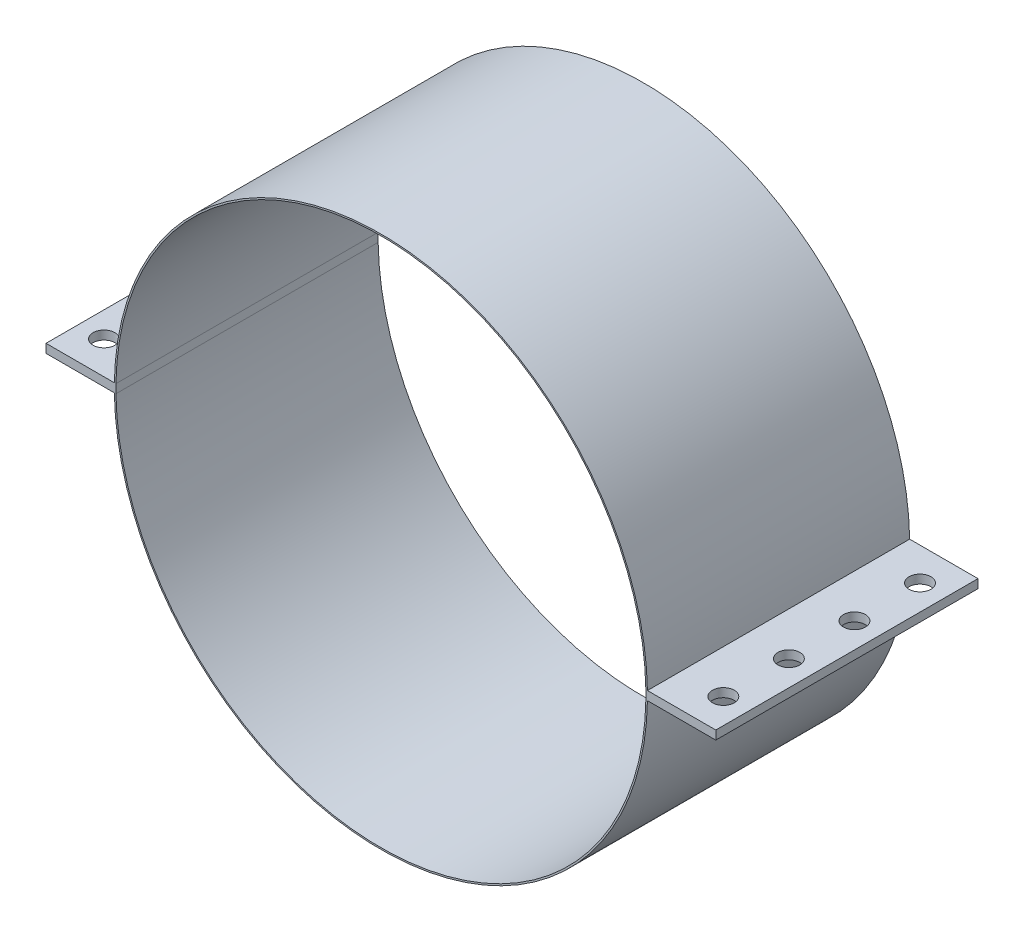
ISO-10303-21;
HEADER;
FILE_DESCRIPTION(('STEP AP214'),'2;1');
FILE_NAME('part.step','',(''),(''),'','','');
FILE_SCHEMA(('AUTOMOTIVE_DESIGN { 1 0 10303 214 1 1 1 1 }'));
ENDSEC;
DATA;
#1=APPLICATION_CONTEXT('core data for automotive mechanical design processes');
#2=APPLICATION_PROTOCOL_DEFINITION('international standard','automotive_design',2000,#1);
#3=PRODUCT_CONTEXT('',#1,'mechanical');
#4=PRODUCT('Part','Part','',(#3));
#5=PRODUCT_RELATED_PRODUCT_CATEGORY('part','',(#4));
#6=PRODUCT_DEFINITION_FORMATION('','',#4);
#7=PRODUCT_DEFINITION_CONTEXT('part definition',#1,'design');
#8=PRODUCT_DEFINITION('design','',#6,#7);
#9=PRODUCT_DEFINITION_SHAPE('','',#8);
#10=(LENGTH_UNIT() NAMED_UNIT(*) SI_UNIT(.MILLI.,.METRE.));
#11=(NAMED_UNIT(*) PLANE_ANGLE_UNIT() SI_UNIT($,.RADIAN.));
#12=(NAMED_UNIT(*) SI_UNIT($,.STERADIAN.) SOLID_ANGLE_UNIT());
#13=UNCERTAINTY_MEASURE_WITH_UNIT(LENGTH_MEASURE(1.E-05),#10,'distance_accuracy_value','');
#14=(GEOMETRIC_REPRESENTATION_CONTEXT(3) GLOBAL_UNCERTAINTY_ASSIGNED_CONTEXT((#13)) GLOBAL_UNIT_ASSIGNED_CONTEXT((#10,
#11,#12)) REPRESENTATION_CONTEXT('',''));
#15=CARTESIAN_POINT('',(0.,0.,0.));
#16=DIRECTION('',(0.,0.,1.));
#17=DIRECTION('',(1.,0.,0.));
#18=AXIS2_PLACEMENT_3D('',#15,#16,#17);
#19=CARTESIAN_POINT('',(0.,0.,76.2));
#20=DIRECTION('',(0.,0.,-1.));
#21=DIRECTION('',(-1.,0.,0.));
#22=AXIS2_PLACEMENT_3D('',#19,#20,#21);
#23=CYLINDRICAL_SURFACE('',#22,77.47);
#24=CARTESIAN_POINT('',(0.,0.,76.2));
#25=DIRECTION('',(0.,0.,1.));
#26=DIRECTION('',(1.,0.,0.));
#27=AXIS2_PLACEMENT_3D('',#24,#25,#26);
#28=CIRCLE('',#27,77.47);
#29=CARTESIAN_POINT('',(-77.4595894644427,-1.26999999999998,76.2));
#30=VERTEX_POINT('',#29);
#31=CARTESIAN_POINT('',(77.4595894644427,-1.27,76.2));
#32=VERTEX_POINT('',#31);
#33=EDGE_CURVE('E46',#30,#32,#28,.T.);
#34=ORIENTED_EDGE('',*,*,#33,.F.);
#35=DIRECTION('',(0.,0.,-1.));
#36=VECTOR('',#35,1.);
#37=CARTESIAN_POINT('',(-77.4595894644427,-1.26999999999998,76.2));
#38=LINE('',#37,#36);
#39=CARTESIAN_POINT('',(-77.4595894644427,-1.26999999999998,0.));
#40=VERTEX_POINT('',#39);
#41=EDGE_CURVE('E154',#30,#40,#38,.T.);
#42=ORIENTED_EDGE('',*,*,#41,.T.);
#43=CARTESIAN_POINT('',(0.,0.,0.));
#44=DIRECTION('',(0.,0.,1.));
#45=DIRECTION('',(1.,0.,0.));
#46=AXIS2_PLACEMENT_3D('',#43,#44,#45);
#47=CIRCLE('',#46,77.47);
#48=CARTESIAN_POINT('',(77.4595894644427,-1.27,0.));
#49=VERTEX_POINT('',#48);
#50=EDGE_CURVE('E205',#40,#49,#47,.T.);
#51=ORIENTED_EDGE('',*,*,#50,.T.);
#52=DIRECTION('',(0.,0.,-1.));
#53=VECTOR('',#52,1.);
#54=CARTESIAN_POINT('',(77.4595894644427,-1.27,76.2));
#55=LINE('',#54,#53);
#56=EDGE_CURVE('E193',#49,#32,#55,.F.);
#57=ORIENTED_EDGE('',*,*,#56,.T.);
#58=EDGE_LOOP('',(#34,#42,#51,#57));
#59=FACE_BOUND('',#58,.T.);
#60=ADVANCED_FACE('F37',(#59),#23,.T.);
#61=CARTESIAN_POINT('',(0.,0.,76.2));
#62=DIRECTION('',(0.,0.,-1.));
#63=DIRECTION('',(-1.,0.,0.));
#64=AXIS2_PLACEMENT_3D('',#61,#62,#63);
#65=CYLINDRICAL_SURFACE('',#64,77.0128);
#66=DIRECTION('',(0.,0.,1.));
#67=VECTOR('',#66,1.);
#68=CARTESIAN_POINT('',(-77.0023276520911,-1.26999999999998,0.));
#69=LINE('',#68,#67);
#70=CARTESIAN_POINT('',(-77.0023276520912,-1.26999999999998,0.));
#71=VERTEX_POINT('',#70);
#72=CARTESIAN_POINT('',(-77.0023276520911,-1.26999999999998,76.2));
#73=VERTEX_POINT('',#72);
#74=EDGE_CURVE('E139',#71,#73,#69,.T.);
#75=ORIENTED_EDGE('',*,*,#74,.T.);
#76=CARTESIAN_POINT('',(0.,0.,76.2));
#77=DIRECTION('',(0.,0.,1.));
#78=DIRECTION('',(1.,0.,0.));
#79=AXIS2_PLACEMENT_3D('',#76,#77,#78);
#80=CIRCLE('',#79,77.0128);
#81=CARTESIAN_POINT('',(77.0023276520912,-1.27,76.2));
#82=VERTEX_POINT('',#81);
#83=EDGE_CURVE('E129',#73,#82,#80,.T.);
#84=ORIENTED_EDGE('',*,*,#83,.T.);
#85=DIRECTION('',(0.,0.,1.));
#86=VECTOR('',#85,1.);
#87=CARTESIAN_POINT('',(77.0023276520912,-1.27,0.));
#88=LINE('',#87,#86);
#89=CARTESIAN_POINT('',(77.0023276520912,-1.27,0.));
#90=VERTEX_POINT('',#89);
#91=EDGE_CURVE('E182',#90,#82,#88,.T.);
#92=ORIENTED_EDGE('',*,*,#91,.F.);
#93=CARTESIAN_POINT('',(0.,0.,0.));
#94=DIRECTION('',(0.,0.,1.));
#95=DIRECTION('',(1.,0.,0.));
#96=AXIS2_PLACEMENT_3D('',#93,#94,#95);
#97=CIRCLE('',#96,77.0128);
#98=EDGE_CURVE('E61',#71,#90,#97,.T.);
#99=ORIENTED_EDGE('',*,*,#98,.F.);
#100=EDGE_LOOP('',(#75,#84,#92,#99));
#101=FACE_BOUND('',#100,.T.);
#102=ADVANCED_FACE('F140',(#101),#65,.F.);
#103=CARTESIAN_POINT('',(0.,0.,76.2));
#104=DIRECTION('',(0.,0.,1.));
#105=DIRECTION('',(1.,0.,0.));
#106=AXIS2_PLACEMENT_3D('',#103,#104,#105);
#107=PLANE('',#106);
#108=ORIENTED_EDGE('',*,*,#83,.F.);
#109=DIRECTION('',(0.,1.,0.));
#110=VECTOR('',#109,1.);
#111=CARTESIAN_POINT('',(-77.0023276520911,-1.26999999999998,76.2));
#112=LINE('',#111,#110);
#113=CARTESIAN_POINT('',(-77.0023276520911,1.27000000000192,76.2));
#114=VERTEX_POINT('',#113);
#115=EDGE_CURVE('E132',#73,#114,#112,.T.);
#116=ORIENTED_EDGE('',*,*,#115,.T.);
#117=CARTESIAN_POINT('',(77.0023276520912,1.27,76.2));
#118=VERTEX_POINT('',#117);
#119=EDGE_CURVE('E136',#118,#114,#80,.T.);
#120=ORIENTED_EDGE('',*,*,#119,.F.);
#121=DIRECTION('',(0.,-1.,0.));
#122=VECTOR('',#121,1.);
#123=CARTESIAN_POINT('',(77.0023276520912,-1.27,76.2));
#124=LINE('',#123,#122);
#125=EDGE_CURVE('E134',#118,#82,#124,.T.);
#126=ORIENTED_EDGE('',*,*,#125,.T.);
#127=EDGE_LOOP('',(#108,#116,#120,#126));
#128=FACE_BOUND('',#127,.T.);
#129=DIRECTION('',(1.,0.,0.));
#130=VECTOR('',#129,1.);
#131=CARTESIAN_POINT('',(-77.0023276520911,-1.26999999999998,76.2));
#132=LINE('',#131,#130);
#133=CARTESIAN_POINT('',(-97.3223276520911,-1.26999999999998,76.2));
#134=VERTEX_POINT('',#133);
#135=EDGE_CURVE('E53',#134,#30,#132,.T.);
#136=ORIENTED_EDGE('',*,*,#135,.T.);
#137=ORIENTED_EDGE('',*,*,#33,.T.);
#138=DIRECTION('',(1.,0.,0.));
#139=VECTOR('',#138,1.);
#140=CARTESIAN_POINT('',(77.0023276520912,-1.27,76.2));
#141=LINE('',#140,#139);
#142=CARTESIAN_POINT('',(97.3223276520912,-1.27,76.2));
#143=VERTEX_POINT('',#142);
#144=EDGE_CURVE('E184',#32,#143,#141,.T.);
#145=ORIENTED_EDGE('',*,*,#144,.T.);
#146=DIRECTION('',(0.,1.,0.));
#147=VECTOR('',#146,1.);
#148=CARTESIAN_POINT('',(97.3223276520912,-1.27,76.2));
#149=LINE('',#148,#147);
#150=CARTESIAN_POINT('',(97.3223276520912,1.27,76.2));
#151=VERTEX_POINT('',#150);
#152=EDGE_CURVE('E186',#143,#151,#149,.T.);
#153=ORIENTED_EDGE('',*,*,#152,.T.);
#154=DIRECTION('',(-1.,0.,0.));
#155=VECTOR('',#154,1.);
#156=CARTESIAN_POINT('',(77.0023276520912,1.27,76.2));
#157=LINE('',#156,#155);
#158=CARTESIAN_POINT('',(77.4595894644427,1.27,76.2));
#159=VERTEX_POINT('',#158);
#160=EDGE_CURVE('E175',#151,#159,#157,.T.);
#161=ORIENTED_EDGE('',*,*,#160,.T.);
#162=CARTESIAN_POINT('',(-77.4595894644427,1.26999999999998,76.2));
#163=VERTEX_POINT('',#162);
#164=EDGE_CURVE('E11',#159,#163,#28,.T.);
#165=ORIENTED_EDGE('',*,*,#164,.T.);
#166=DIRECTION('',(-1.,0.,0.));
#167=VECTOR('',#166,1.);
#168=CARTESIAN_POINT('',(-77.0023276520911,1.26999999999998,76.2));
#169=LINE('',#168,#167);
#170=CARTESIAN_POINT('',(-97.3223276520911,1.26999999999998,76.2));
#171=VERTEX_POINT('',#170);
#172=EDGE_CURVE('E151',#163,#171,#169,.T.);
#173=ORIENTED_EDGE('',*,*,#172,.T.);
#174=DIRECTION('',(0.,-1.,0.));
#175=VECTOR('',#174,1.);
#176=CARTESIAN_POINT('',(-97.3223276520911,-1.26999999999998,76.2));
#177=LINE('',#176,#175);
#178=EDGE_CURVE('E156',#171,#134,#177,.T.);
#179=ORIENTED_EDGE('',*,*,#178,.T.);
#180=EDGE_LOOP('',(#136,#137,#145,#153,#161,#165,#173,#179));
#181=FACE_BOUND('',#180,.T.);
#182=ADVANCED_FACE('F130',(#128,#181),#107,.T.);
#183=CARTESIAN_POINT('',(0.,0.,0.));
#184=DIRECTION('',(0.,0.,1.));
#185=DIRECTION('',(1.,0.,0.));
#186=AXIS2_PLACEMENT_3D('',#183,#184,#185);
#187=PLANE('',#186);
#188=DIRECTION('',(0.,1.,0.));
#189=VECTOR('',#188,1.);
#190=CARTESIAN_POINT('',(-77.0023276520911,-1.26999999999998,0.));
#191=LINE('',#190,#189);
#192=CARTESIAN_POINT('',(-77.0023276520911,1.27000000000192,0.));
#193=VERTEX_POINT('',#192);
#194=EDGE_CURVE('E167',#71,#193,#191,.T.);
#195=ORIENTED_EDGE('',*,*,#194,.F.);
#196=ORIENTED_EDGE('',*,*,#98,.T.);
#197=DIRECTION('',(0.,-1.,0.));
#198=VECTOR('',#197,1.);
#199=CARTESIAN_POINT('',(77.0023276520912,-1.27,0.));
#200=LINE('',#199,#198);
#201=CARTESIAN_POINT('',(77.0023276520912,1.27,0.));
#202=VERTEX_POINT('',#201);
#203=EDGE_CURVE('E171',#202,#90,#200,.T.);
#204=ORIENTED_EDGE('',*,*,#203,.F.);
#205=EDGE_CURVE('E137',#202,#193,#97,.T.);
#206=ORIENTED_EDGE('',*,*,#205,.T.);
#207=EDGE_LOOP('',(#195,#196,#204,#206));
#208=FACE_BOUND('',#207,.T.);
#209=ORIENTED_EDGE('',*,*,#50,.F.);
#210=DIRECTION('',(1.,0.,0.));
#211=VECTOR('',#210,1.);
#212=CARTESIAN_POINT('',(-77.0023276520911,-1.26999999999998,0.));
#213=LINE('',#212,#211);
#214=CARTESIAN_POINT('',(-97.3223276520911,-1.26999999999998,0.));
#215=VERTEX_POINT('',#214);
#216=EDGE_CURVE('E160',#215,#40,#213,.T.);
#217=ORIENTED_EDGE('',*,*,#216,.F.);
#218=DIRECTION('',(0.,-1.,0.));
#219=VECTOR('',#218,1.);
#220=CARTESIAN_POINT('',(-97.3223276520911,-1.26999999999998,0.));
#221=LINE('',#220,#219);
#222=CARTESIAN_POINT('',(-97.3223276520911,1.26999999999998,0.));
#223=VERTEX_POINT('',#222);
#224=EDGE_CURVE('E162',#223,#215,#221,.T.);
#225=ORIENTED_EDGE('',*,*,#224,.F.);
#226=DIRECTION('',(-1.,0.,0.));
#227=VECTOR('',#226,1.);
#228=CARTESIAN_POINT('',(-77.0023276520911,1.26999999999998,0.));
#229=LINE('',#228,#227);
#230=CARTESIAN_POINT('',(-77.4595894644427,1.26999999999998,0.));
#231=VERTEX_POINT('',#230);
#232=EDGE_CURVE('E165',#231,#223,#229,.T.);
#233=ORIENTED_EDGE('',*,*,#232,.F.);
#234=CARTESIAN_POINT('',(77.4595894644427,1.27,0.));
#235=VERTEX_POINT('',#234);
#236=EDGE_CURVE('E41',#235,#231,#47,.T.);
#237=ORIENTED_EDGE('',*,*,#236,.F.);
#238=DIRECTION('',(-1.,0.,0.));
#239=VECTOR('',#238,1.);
#240=CARTESIAN_POINT('',(77.0023276520912,1.27,0.));
#241=LINE('',#240,#239);
#242=CARTESIAN_POINT('',(97.3223276520912,1.27,0.));
#243=VERTEX_POINT('',#242);
#244=EDGE_CURVE('E180',#243,#235,#241,.T.);
#245=ORIENTED_EDGE('',*,*,#244,.F.);
#246=DIRECTION('',(0.,1.,0.));
#247=VECTOR('',#246,1.);
#248=CARTESIAN_POINT('',(97.3223276520912,-1.27,0.));
#249=LINE('',#248,#247);
#250=CARTESIAN_POINT('',(97.3223276520912,-1.27,0.));
#251=VERTEX_POINT('',#250);
#252=EDGE_CURVE('E177',#251,#243,#249,.T.);
#253=ORIENTED_EDGE('',*,*,#252,.F.);
#254=DIRECTION('',(1.,0.,0.));
#255=VECTOR('',#254,1.);
#256=CARTESIAN_POINT('',(77.0023276520912,-1.27,0.));
#257=LINE('',#256,#255);
#258=EDGE_CURVE('E174',#49,#251,#257,.T.);
#259=ORIENTED_EDGE('',*,*,#258,.F.);
#260=EDGE_LOOP('',(#209,#217,#225,#233,#237,#245,#253,#259));
#261=FACE_BOUND('',#260,.T.);
#262=ADVANCED_FACE('F209',(#208,#261),#187,.F.);
#263=ORIENTED_EDGE('',*,*,#236,.T.);
#264=DIRECTION('',(0.,0.,-1.));
#265=VECTOR('',#264,1.);
#266=CARTESIAN_POINT('',(-77.4595894644427,1.26999999999998,76.2));
#267=LINE('',#266,#265);
#268=EDGE_CURVE('E150',#231,#163,#267,.F.);
#269=ORIENTED_EDGE('',*,*,#268,.T.);
#270=ORIENTED_EDGE('',*,*,#164,.F.);
#271=DIRECTION('',(0.,0.,-1.));
#272=VECTOR('',#271,1.);
#273=CARTESIAN_POINT('',(77.4595894644427,1.27,76.2));
#274=LINE('',#273,#272);
#275=EDGE_CURVE('E202',#159,#235,#274,.T.);
#276=ORIENTED_EDGE('',*,*,#275,.T.);
#277=EDGE_LOOP('',(#263,#269,#270,#276));
#278=FACE_BOUND('',#277,.T.);
#279=ADVANCED_FACE('F39',(#278),#23,.T.);
#280=DIRECTION('',(0.,0.,1.));
#281=VECTOR('',#280,1.);
#282=CARTESIAN_POINT('',(-77.0023276520911,1.26999999999998,0.));
#283=LINE('',#282,#281);
#284=EDGE_CURVE('E149',#193,#114,#283,.T.);
#285=ORIENTED_EDGE('',*,*,#284,.F.);
#286=ORIENTED_EDGE('',*,*,#205,.F.);
#287=DIRECTION('',(0.,0.,1.));
#288=VECTOR('',#287,1.);
#289=CARTESIAN_POINT('',(77.0023276520912,1.27,0.));
#290=LINE('',#289,#288);
#291=EDGE_CURVE('E190',#202,#118,#290,.T.);
#292=ORIENTED_EDGE('',*,*,#291,.T.);
#293=ORIENTED_EDGE('',*,*,#119,.T.);
#294=EDGE_LOOP('',(#285,#286,#292,#293));
#295=FACE_BOUND('',#294,.T.);
#296=ADVANCED_FACE('F215',(#295),#65,.F.);
#297=CARTESIAN_POINT('',(77.0023276520912,-1.27,0.));
#298=DIRECTION('',(-1.,0.,0.));
#299=DIRECTION('',(0.,0.,1.));
#300=AXIS2_PLACEMENT_3D('',#297,#298,#299);
#301=PLANE('',#300);
#302=ORIENTED_EDGE('',*,*,#125,.F.);
#303=ORIENTED_EDGE('',*,*,#291,.F.);
#304=ORIENTED_EDGE('',*,*,#203,.T.);
#305=ORIENTED_EDGE('',*,*,#91,.T.);
#306=EDGE_LOOP('',(#302,#303,#304,#305));
#307=FACE_BOUND('',#306,.T.);
#308=ADVANCED_FACE('F213',(#307),#301,.T.);
#309=CARTESIAN_POINT('',(77.0023276520912,1.27,0.));
#310=DIRECTION('',(0.,1.,0.));
#311=DIRECTION('',(-1.,0.,0.));
#312=AXIS2_PLACEMENT_3D('',#309,#310,#311);
#313=PLANE('',#312);
#314=CARTESIAN_POINT('',(89.9952514644427,1.27,9.52500000000001));
#315=DIRECTION('',(0.,1.,0.));
#316=DIRECTION('',(-1.,0.,0.));
#317=AXIS2_PLACEMENT_3D('',#314,#315,#316);
#318=CIRCLE('',#317,3.175);
#319=CARTESIAN_POINT('',(86.8202514644427,1.27,9.52500000000001));
#320=VERTEX_POINT('',#319);
#321=EDGE_CURVE('E321',#320,#320,#318,.T.);
#322=ORIENTED_EDGE('',*,*,#321,.F.);
#323=EDGE_LOOP('',(#322));
#324=FACE_BOUND('',#323,.T.);
#325=CARTESIAN_POINT('',(89.9952514644427,1.27,28.575));
#326=DIRECTION('',(0.,1.,0.));
#327=DIRECTION('',(-1.,0.,0.));
#328=AXIS2_PLACEMENT_3D('',#325,#326,#327);
#329=CIRCLE('',#328,3.175);
#330=CARTESIAN_POINT('',(86.8202514644427,1.27,28.575));
#331=VERTEX_POINT('',#330);
#332=EDGE_CURVE('E322',#331,#331,#329,.T.);
#333=ORIENTED_EDGE('',*,*,#332,.F.);
#334=EDGE_LOOP('',(#333));
#335=FACE_BOUND('',#334,.T.);
#336=CARTESIAN_POINT('',(89.9952514644427,1.27,47.625));
#337=DIRECTION('',(0.,1.,0.));
#338=DIRECTION('',(-1.,0.,0.));
#339=AXIS2_PLACEMENT_3D('',#336,#337,#338);
#340=CIRCLE('',#339,3.175);
#341=CARTESIAN_POINT('',(86.8202514644427,1.27,47.625));
#342=VERTEX_POINT('',#341);
#343=EDGE_CURVE('E345',#342,#342,#340,.T.);
#344=ORIENTED_EDGE('',*,*,#343,.F.);
#345=EDGE_LOOP('',(#344));
#346=FACE_BOUND('',#345,.T.);
#347=CARTESIAN_POINT('',(89.9952514644427,1.27,66.675));
#348=DIRECTION('',(0.,1.,0.));
#349=DIRECTION('',(-1.,0.,0.));
#350=AXIS2_PLACEMENT_3D('',#347,#348,#349);
#351=CIRCLE('',#350,3.175);
#352=CARTESIAN_POINT('',(86.8202514644427,1.27,66.675));
#353=VERTEX_POINT('',#352);
#354=EDGE_CURVE('E339',#353,#353,#351,.T.);
#355=ORIENTED_EDGE('',*,*,#354,.F.);
#356=EDGE_LOOP('',(#355));
#357=FACE_BOUND('',#356,.T.);
#358=ORIENTED_EDGE('',*,*,#275,.F.);
#359=ORIENTED_EDGE('',*,*,#160,.F.);
#360=DIRECTION('',(0.,0.,1.));
#361=VECTOR('',#360,1.);
#362=CARTESIAN_POINT('',(97.3223276520912,1.27,0.));
#363=LINE('',#362,#361);
#364=EDGE_CURVE('E194',#243,#151,#363,.T.);
#365=ORIENTED_EDGE('',*,*,#364,.F.);
#366=ORIENTED_EDGE('',*,*,#244,.T.);
#367=EDGE_LOOP('',(#358,#359,#365,#366));
#368=FACE_BOUND('',#367,.T.);
#369=ADVANCED_FACE('F251',(#324,#335,#346,#357,#368),#313,.T.);
#370=CARTESIAN_POINT('',(77.0023276520912,-1.27,0.));
#371=DIRECTION('',(0.,-1.,0.));
#372=DIRECTION('',(1.,0.,0.));
#373=AXIS2_PLACEMENT_3D('',#370,#371,#372);
#374=PLANE('',#373);
#375=CARTESIAN_POINT('',(89.9952514644427,-1.27,9.52500000000001));
#376=DIRECTION('',(0.,1.,0.));
#377=DIRECTION('',(-1.,0.,0.));
#378=AXIS2_PLACEMENT_3D('',#375,#376,#377);
#379=CIRCLE('',#378,3.175);
#380=CARTESIAN_POINT('',(86.8202514644427,-1.27,9.52500000000001));
#381=VERTEX_POINT('',#380);
#382=EDGE_CURVE('E318',#381,#381,#379,.T.);
#383=ORIENTED_EDGE('',*,*,#382,.T.);
#384=EDGE_LOOP('',(#383));
#385=FACE_BOUND('',#384,.T.);
#386=CARTESIAN_POINT('',(89.9952514644427,-1.27,28.575));
#387=DIRECTION('',(0.,1.,0.));
#388=DIRECTION('',(-1.,0.,0.));
#389=AXIS2_PLACEMENT_3D('',#386,#387,#388);
#390=CIRCLE('',#389,3.175);
#391=CARTESIAN_POINT('',(86.8202514644427,-1.27,28.575));
#392=VERTEX_POINT('',#391);
#393=EDGE_CURVE('E348',#392,#392,#390,.T.);
#394=ORIENTED_EDGE('',*,*,#393,.T.);
#395=EDGE_LOOP('',(#394));
#396=FACE_BOUND('',#395,.T.);
#397=CARTESIAN_POINT('',(89.9952514644427,-1.27,47.625));
#398=DIRECTION('',(0.,1.,0.));
#399=DIRECTION('',(-1.,0.,0.));
#400=AXIS2_PLACEMENT_3D('',#397,#398,#399);
#401=CIRCLE('',#400,3.175);
#402=CARTESIAN_POINT('',(86.8202514644427,-1.27,47.625));
#403=VERTEX_POINT('',#402);
#404=EDGE_CURVE('E342',#403,#403,#401,.T.);
#405=ORIENTED_EDGE('',*,*,#404,.T.);
#406=EDGE_LOOP('',(#405));
#407=FACE_BOUND('',#406,.T.);
#408=CARTESIAN_POINT('',(89.9952514644427,-1.27,66.675));
#409=DIRECTION('',(0.,1.,0.));
#410=DIRECTION('',(-1.,0.,0.));
#411=AXIS2_PLACEMENT_3D('',#408,#409,#410);
#412=CIRCLE('',#411,3.175);
#413=CARTESIAN_POINT('',(86.8202514644427,-1.27,66.675));
#414=VERTEX_POINT('',#413);
#415=EDGE_CURVE('E336',#414,#414,#412,.T.);
#416=ORIENTED_EDGE('',*,*,#415,.T.);
#417=EDGE_LOOP('',(#416));
#418=FACE_BOUND('',#417,.T.);
#419=ORIENTED_EDGE('',*,*,#56,.F.);
#420=ORIENTED_EDGE('',*,*,#258,.T.);
#421=DIRECTION('',(0.,0.,1.));
#422=VECTOR('',#421,1.);
#423=CARTESIAN_POINT('',(97.3223276520912,-1.27,0.));
#424=LINE('',#423,#422);
#425=EDGE_CURVE('E196',#251,#143,#424,.T.);
#426=ORIENTED_EDGE('',*,*,#425,.T.);
#427=ORIENTED_EDGE('',*,*,#144,.F.);
#428=EDGE_LOOP('',(#419,#420,#426,#427));
#429=FACE_BOUND('',#428,.T.);
#430=ADVANCED_FACE('F241',(#385,#396,#407,#418,#429),#374,.T.);
#431=CARTESIAN_POINT('',(97.3223276520912,-1.27,0.));
#432=DIRECTION('',(1.,0.,0.));
#433=DIRECTION('',(0.,0.,-1.));
#434=AXIS2_PLACEMENT_3D('',#431,#432,#433);
#435=PLANE('',#434);
#436=ORIENTED_EDGE('',*,*,#152,.F.);
#437=ORIENTED_EDGE('',*,*,#425,.F.);
#438=ORIENTED_EDGE('',*,*,#252,.T.);
#439=ORIENTED_EDGE('',*,*,#364,.T.);
#440=EDGE_LOOP('',(#436,#437,#438,#439));
#441=FACE_BOUND('',#440,.T.);
#442=ADVANCED_FACE('F247',(#441),#435,.T.);
#443=CARTESIAN_POINT('',(-77.0023276520911,-1.26999999999998,0.));
#444=DIRECTION('',(1.,0.,0.));
#445=DIRECTION('',(0.,0.,-1.));
#446=AXIS2_PLACEMENT_3D('',#443,#444,#445);
#447=PLANE('',#446);
#448=ORIENTED_EDGE('',*,*,#115,.F.);
#449=ORIENTED_EDGE('',*,*,#74,.F.);
#450=ORIENTED_EDGE('',*,*,#194,.T.);
#451=ORIENTED_EDGE('',*,*,#284,.T.);
#452=EDGE_LOOP('',(#448,#449,#450,#451));
#453=FACE_BOUND('',#452,.T.);
#454=ADVANCED_FACE('F148',(#453),#447,.T.);
#455=CARTESIAN_POINT('',(-77.0023276520911,-1.26999999999998,0.));
#456=DIRECTION('',(0.,-1.,0.));
#457=DIRECTION('',(1.,0.,0.));
#458=AXIS2_PLACEMENT_3D('',#455,#456,#457);
#459=PLANE('',#458);
#460=CARTESIAN_POINT('',(-89.9952514644427,-1.27,47.625));
#461=DIRECTION('',(0.,-1.,0.));
#462=DIRECTION('',(1.,0.,0.));
#463=AXIS2_PLACEMENT_3D('',#460,#461,#462);
#464=CIRCLE('',#463,3.175);
#465=CARTESIAN_POINT('',(-86.8202514644427,-1.27,47.625));
#466=VERTEX_POINT('',#465);
#467=EDGE_CURVE('E304',#466,#466,#464,.T.);
#468=ORIENTED_EDGE('',*,*,#467,.F.);
#469=EDGE_LOOP('',(#468));
#470=FACE_BOUND('',#469,.T.);
#471=CARTESIAN_POINT('',(-89.9952514644427,-1.27,28.575));
#472=DIRECTION('',(0.,-1.,0.));
#473=DIRECTION('',(1.,0.,0.));
#474=AXIS2_PLACEMENT_3D('',#471,#472,#473);
#475=CIRCLE('',#474,3.175);
#476=CARTESIAN_POINT('',(-86.8202514644427,-1.27,28.575));
#477=VERTEX_POINT('',#476);
#478=EDGE_CURVE('E308',#477,#477,#475,.T.);
#479=ORIENTED_EDGE('',*,*,#478,.F.);
#480=EDGE_LOOP('',(#479));
#481=FACE_BOUND('',#480,.T.);
#482=CARTESIAN_POINT('',(-89.9952514644427,-1.27,9.52500000000003));
#483=DIRECTION('',(0.,-1.,0.));
#484=DIRECTION('',(1.,0.,0.));
#485=AXIS2_PLACEMENT_3D('',#482,#483,#484);
#486=CIRCLE('',#485,3.175);
#487=CARTESIAN_POINT('',(-86.8202514644427,-1.27,9.52500000000003));
#488=VERTEX_POINT('',#487);
#489=EDGE_CURVE('E312',#488,#488,#486,.T.);
#490=ORIENTED_EDGE('',*,*,#489,.F.);
#491=EDGE_LOOP('',(#490));
#492=FACE_BOUND('',#491,.T.);
#493=CARTESIAN_POINT('',(-89.9952514644427,-1.27,66.675));
#494=DIRECTION('',(0.,-1.,0.));
#495=DIRECTION('',(1.,0.,0.));
#496=AXIS2_PLACEMENT_3D('',#493,#494,#495);
#497=CIRCLE('',#496,3.175);
#498=CARTESIAN_POINT('',(-86.8202514644427,-1.27,66.675));
#499=VERTEX_POINT('',#498);
#500=EDGE_CURVE('E145',#499,#499,#497,.T.);
#501=ORIENTED_EDGE('',*,*,#500,.F.);
#502=EDGE_LOOP('',(#501));
#503=FACE_BOUND('',#502,.T.);
#504=ORIENTED_EDGE('',*,*,#41,.F.);
#505=ORIENTED_EDGE('',*,*,#135,.F.);
#506=DIRECTION('',(0.,0.,1.));
#507=VECTOR('',#506,1.);
#508=CARTESIAN_POINT('',(-97.3223276520911,-1.26999999999998,0.));
#509=LINE('',#508,#507);
#510=EDGE_CURVE('E144',#215,#134,#509,.T.);
#511=ORIENTED_EDGE('',*,*,#510,.F.);
#512=ORIENTED_EDGE('',*,*,#216,.T.);
#513=EDGE_LOOP('',(#504,#505,#511,#512));
#514=FACE_BOUND('',#513,.T.);
#515=ADVANCED_FACE('F229',(#470,#481,#492,#503,#514),#459,.T.);
#516=CARTESIAN_POINT('',(-77.0023276520911,1.26999999999998,0.));
#517=DIRECTION('',(0.,1.,0.));
#518=DIRECTION('',(-1.,0.,0.));
#519=AXIS2_PLACEMENT_3D('',#516,#517,#518);
#520=PLANE('',#519);
#521=CARTESIAN_POINT('',(-89.9952514644427,1.27,47.625));
#522=DIRECTION('',(0.,-1.,0.));
#523=DIRECTION('',(1.,0.,0.));
#524=AXIS2_PLACEMENT_3D('',#521,#522,#523);
#525=CIRCLE('',#524,3.175);
#526=CARTESIAN_POINT('',(-86.8202514644427,1.27,47.625));
#527=VERTEX_POINT('',#526);
#528=EDGE_CURVE('E316',#527,#527,#525,.T.);
#529=ORIENTED_EDGE('',*,*,#528,.T.);
#530=EDGE_LOOP('',(#529));
#531=FACE_BOUND('',#530,.T.);
#532=CARTESIAN_POINT('',(-89.9952514644427,1.27,28.575));
#533=DIRECTION('',(0.,-1.,0.));
#534=DIRECTION('',(1.,0.,0.));
#535=AXIS2_PLACEMENT_3D('',#532,#533,#534);
#536=CIRCLE('',#535,3.175);
#537=CARTESIAN_POINT('',(-86.8202514644427,1.27,28.575));
#538=VERTEX_POINT('',#537);
#539=EDGE_CURVE('E330',#538,#538,#536,.T.);
#540=ORIENTED_EDGE('',*,*,#539,.T.);
#541=EDGE_LOOP('',(#540));
#542=FACE_BOUND('',#541,.T.);
#543=CARTESIAN_POINT('',(-89.9952514644427,1.27,9.52500000000003));
#544=DIRECTION('',(0.,-1.,0.));
#545=DIRECTION('',(1.,0.,0.));
#546=AXIS2_PLACEMENT_3D('',#543,#544,#545);
#547=CIRCLE('',#546,3.175);
#548=CARTESIAN_POINT('',(-86.8202514644427,1.27,9.52500000000003));
#549=VERTEX_POINT('',#548);
#550=EDGE_CURVE('E326',#549,#549,#547,.T.);
#551=ORIENTED_EDGE('',*,*,#550,.T.);
#552=EDGE_LOOP('',(#551));
#553=FACE_BOUND('',#552,.T.);
#554=CARTESIAN_POINT('',(-89.9952514644427,1.27,66.675));
#555=DIRECTION('',(0.,-1.,0.));
#556=DIRECTION('',(1.,0.,0.));
#557=AXIS2_PLACEMENT_3D('',#554,#555,#556);
#558=CIRCLE('',#557,3.175);
#559=CARTESIAN_POINT('',(-86.8202514644427,1.27,66.675));
#560=VERTEX_POINT('',#559);
#561=EDGE_CURVE('E221',#560,#560,#558,.T.);
#562=ORIENTED_EDGE('',*,*,#561,.T.);
#563=EDGE_LOOP('',(#562));
#564=FACE_BOUND('',#563,.T.);
#565=ORIENTED_EDGE('',*,*,#268,.F.);
#566=ORIENTED_EDGE('',*,*,#232,.T.);
#567=DIRECTION('',(0.,0.,1.));
#568=VECTOR('',#567,1.);
#569=CARTESIAN_POINT('',(-97.3223276520911,1.26999999999998,0.));
#570=LINE('',#569,#568);
#571=EDGE_CURVE('E216',#223,#171,#570,.T.);
#572=ORIENTED_EDGE('',*,*,#571,.T.);
#573=ORIENTED_EDGE('',*,*,#172,.F.);
#574=EDGE_LOOP('',(#565,#566,#572,#573));
#575=FACE_BOUND('',#574,.T.);
#576=ADVANCED_FACE('F255',(#531,#542,#553,#564,#575),#520,.T.);
#577=CARTESIAN_POINT('',(-97.3223276520911,-1.26999999999998,0.));
#578=DIRECTION('',(-1.,0.,0.));
#579=DIRECTION('',(0.,0.,1.));
#580=AXIS2_PLACEMENT_3D('',#577,#578,#579);
#581=PLANE('',#580);
#582=ORIENTED_EDGE('',*,*,#178,.F.);
#583=ORIENTED_EDGE('',*,*,#571,.F.);
#584=ORIENTED_EDGE('',*,*,#224,.T.);
#585=ORIENTED_EDGE('',*,*,#510,.T.);
#586=EDGE_LOOP('',(#582,#583,#584,#585));
#587=FACE_BOUND('',#586,.T.);
#588=ADVANCED_FACE('F257',(#587),#581,.T.);
#589=CARTESIAN_POINT('',(-89.9952514644427,-1.27,66.675));
#590=DIRECTION('',(0.,1.,0.));
#591=DIRECTION('',(-1.,0.,0.));
#592=AXIS2_PLACEMENT_3D('',#589,#590,#591);
#593=CYLINDRICAL_SURFACE('',#592,3.175);
#594=ORIENTED_EDGE('',*,*,#500,.T.);
#595=EDGE_LOOP('',(#594));
#596=FACE_BOUND('',#595,.T.);
#597=ORIENTED_EDGE('',*,*,#561,.F.);
#598=EDGE_LOOP('',(#597));
#599=FACE_BOUND('',#598,.T.);
#600=ADVANCED_FACE('F259',(#596,#599),#593,.F.);
#601=CARTESIAN_POINT('',(-89.9952514644427,-1.27,9.52500000000003));
#602=DIRECTION('',(0.,1.,0.));
#603=DIRECTION('',(-1.,0.,0.));
#604=AXIS2_PLACEMENT_3D('',#601,#602,#603);
#605=CYLINDRICAL_SURFACE('',#604,3.175);
#606=ORIENTED_EDGE('',*,*,#489,.T.);
#607=EDGE_LOOP('',(#606));
#608=FACE_BOUND('',#607,.T.);
#609=ORIENTED_EDGE('',*,*,#550,.F.);
#610=EDGE_LOOP('',(#609));
#611=FACE_BOUND('',#610,.T.);
#612=ADVANCED_FACE('F265',(#608,#611),#605,.F.);
#613=CARTESIAN_POINT('',(-89.9952514644427,-1.27,28.575));
#614=DIRECTION('',(0.,1.,0.));
#615=DIRECTION('',(-1.,0.,0.));
#616=AXIS2_PLACEMENT_3D('',#613,#614,#615);
#617=CYLINDRICAL_SURFACE('',#616,3.175);
#618=ORIENTED_EDGE('',*,*,#478,.T.);
#619=EDGE_LOOP('',(#618));
#620=FACE_BOUND('',#619,.T.);
#621=ORIENTED_EDGE('',*,*,#539,.F.);
#622=EDGE_LOOP('',(#621));
#623=FACE_BOUND('',#622,.T.);
#624=ADVANCED_FACE('F373',(#620,#623),#617,.F.);
#625=CARTESIAN_POINT('',(-89.9952514644427,-1.27,47.625));
#626=DIRECTION('',(0.,1.,0.));
#627=DIRECTION('',(-1.,0.,0.));
#628=AXIS2_PLACEMENT_3D('',#625,#626,#627);
#629=CYLINDRICAL_SURFACE('',#628,3.175);
#630=ORIENTED_EDGE('',*,*,#467,.T.);
#631=EDGE_LOOP('',(#630));
#632=FACE_BOUND('',#631,.T.);
#633=ORIENTED_EDGE('',*,*,#528,.F.);
#634=EDGE_LOOP('',(#633));
#635=FACE_BOUND('',#634,.T.);
#636=ADVANCED_FACE('F364',(#632,#635),#629,.F.);
#637=CARTESIAN_POINT('',(89.9952514644427,-1.27,66.675));
#638=DIRECTION('',(0.,1.,0.));
#639=DIRECTION('',(-1.,0.,0.));
#640=AXIS2_PLACEMENT_3D('',#637,#638,#639);
#641=CYLINDRICAL_SURFACE('',#640,3.175);
#642=ORIENTED_EDGE('',*,*,#415,.F.);
#643=EDGE_LOOP('',(#642));
#644=FACE_BOUND('',#643,.T.);
#645=ORIENTED_EDGE('',*,*,#354,.T.);
#646=EDGE_LOOP('',(#645));
#647=FACE_BOUND('',#646,.T.);
#648=ADVANCED_FACE('F361',(#644,#647),#641,.F.);
#649=CARTESIAN_POINT('',(89.9952514644427,-1.27,47.625));
#650=DIRECTION('',(0.,1.,0.));
#651=DIRECTION('',(-1.,0.,0.));
#652=AXIS2_PLACEMENT_3D('',#649,#650,#651);
#653=CYLINDRICAL_SURFACE('',#652,3.175);
#654=ORIENTED_EDGE('',*,*,#404,.F.);
#655=EDGE_LOOP('',(#654));
#656=FACE_BOUND('',#655,.T.);
#657=ORIENTED_EDGE('',*,*,#343,.T.);
#658=EDGE_LOOP('',(#657));
#659=FACE_BOUND('',#658,.T.);
#660=ADVANCED_FACE('F363',(#656,#659),#653,.F.);
#661=CARTESIAN_POINT('',(89.9952514644427,-1.27,28.575));
#662=DIRECTION('',(0.,1.,0.));
#663=DIRECTION('',(-1.,0.,0.));
#664=AXIS2_PLACEMENT_3D('',#661,#662,#663);
#665=CYLINDRICAL_SURFACE('',#664,3.175);
#666=ORIENTED_EDGE('',*,*,#393,.F.);
#667=EDGE_LOOP('',(#666));
#668=FACE_BOUND('',#667,.T.);
#669=ORIENTED_EDGE('',*,*,#332,.T.);
#670=EDGE_LOOP('',(#669));
#671=FACE_BOUND('',#670,.T.);
#672=ADVANCED_FACE('F354',(#668,#671),#665,.F.);
#673=CARTESIAN_POINT('',(89.9952514644427,-1.27,9.52500000000001));
#674=DIRECTION('',(0.,1.,0.));
#675=DIRECTION('',(-1.,0.,0.));
#676=AXIS2_PLACEMENT_3D('',#673,#674,#675);
#677=CYLINDRICAL_SURFACE('',#676,3.175);
#678=ORIENTED_EDGE('',*,*,#382,.F.);
#679=EDGE_LOOP('',(#678));
#680=FACE_BOUND('',#679,.T.);
#681=ORIENTED_EDGE('',*,*,#321,.T.);
#682=EDGE_LOOP('',(#681));
#683=FACE_BOUND('',#682,.T.);
#684=ADVANCED_FACE('F385',(#680,#683),#677,.F.);
#685=CLOSED_SHELL('',(#60,#102,#182,#262,#279,#296,#308,#369,#430,#442,#454,#515,#576,#588,#600,
#612,#624,#636,#648,#660,#672,#684));
#686=MANIFOLD_SOLID_BREP('B2',#685);
#687=ADVANCED_BREP_SHAPE_REPRESENTATION('',(#18,#686),#14);
#688=SHAPE_DEFINITION_REPRESENTATION(#9,#687);
ENDSEC;
END-ISO-10303-21;
